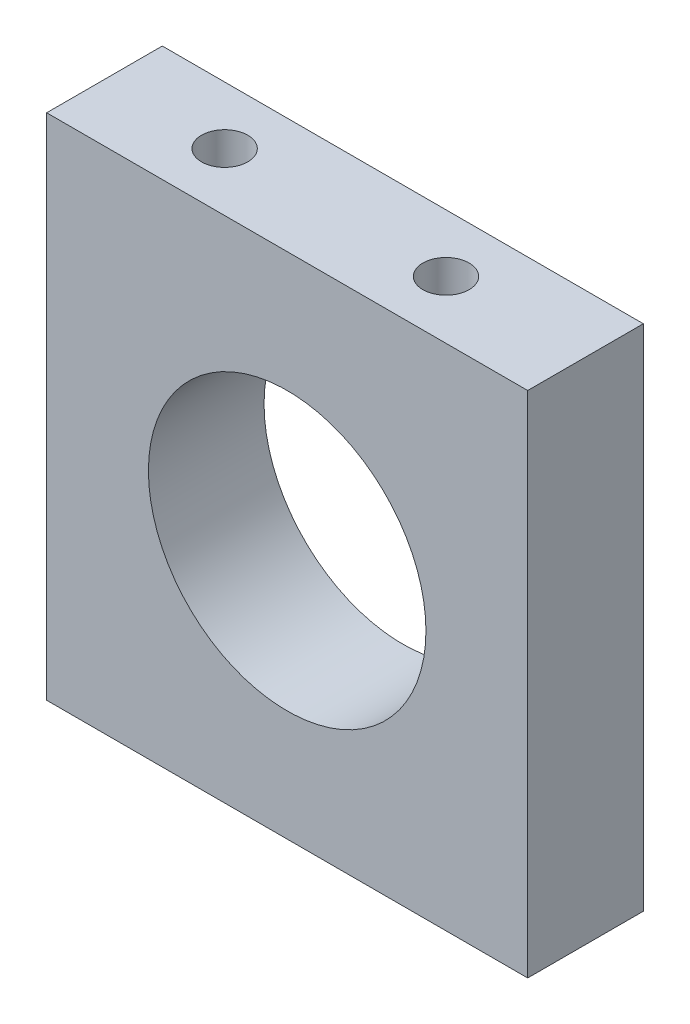
ISO-10303-21;
HEADER;
FILE_DESCRIPTION(('STEP AP214'),'2;1');
FILE_NAME('part.step','',(''),(''),'','','');
FILE_SCHEMA(('AUTOMOTIVE_DESIGN { 1 0 10303 214 1 1 1 1 }'));
ENDSEC;
DATA;
#1=APPLICATION_CONTEXT('core data for automotive mechanical design processes');
#2=APPLICATION_PROTOCOL_DEFINITION('international standard','automotive_design',2000,#1);
#3=PRODUCT_CONTEXT('',#1,'mechanical');
#4=PRODUCT('Part','Part','',(#3));
#5=PRODUCT_RELATED_PRODUCT_CATEGORY('part','',(#4));
#6=PRODUCT_DEFINITION_FORMATION('','',#4);
#7=PRODUCT_DEFINITION_CONTEXT('part definition',#1,'design');
#8=PRODUCT_DEFINITION('design','',#6,#7);
#9=PRODUCT_DEFINITION_SHAPE('','',#8);
#10=(LENGTH_UNIT() NAMED_UNIT(*) SI_UNIT(.MILLI.,.METRE.));
#11=(NAMED_UNIT(*) PLANE_ANGLE_UNIT() SI_UNIT($,.RADIAN.));
#12=(NAMED_UNIT(*) SI_UNIT($,.STERADIAN.) SOLID_ANGLE_UNIT());
#13=UNCERTAINTY_MEASURE_WITH_UNIT(LENGTH_MEASURE(1.E-05),#10,'distance_accuracy_value','');
#14=(GEOMETRIC_REPRESENTATION_CONTEXT(3) GLOBAL_UNCERTAINTY_ASSIGNED_CONTEXT((#13)) GLOBAL_UNIT_ASSIGNED_CONTEXT((#10,
#11,#12)) REPRESENTATION_CONTEXT('',''));
#15=CARTESIAN_POINT('',(0.,0.,0.));
#16=DIRECTION('',(0.,0.,1.));
#17=DIRECTION('',(1.,0.,0.));
#18=AXIS2_PLACEMENT_3D('',#15,#16,#17);
#19=CARTESIAN_POINT('',(26.,0.,12.5));
#20=DIRECTION('',(-1.,0.,0.));
#21=DIRECTION('',(0.,0.,1.));
#22=AXIS2_PLACEMENT_3D('',#19,#20,#21);
#23=PLANE('',#22);
#24=DIRECTION('',(0.,1.,0.));
#25=VECTOR('',#24,1.);
#26=CARTESIAN_POINT('',(26.,0.,0.));
#27=LINE('',#26,#25);
#28=CARTESIAN_POINT('',(26.,0.,0.));
#29=VERTEX_POINT('',#28);
#30=CARTESIAN_POINT('',(26.,55.,0.));
#31=VERTEX_POINT('',#30);
#32=EDGE_CURVE('E124',#29,#31,#27,.T.);
#33=ORIENTED_EDGE('',*,*,#32,.T.);
#34=DIRECTION('',(0.,0.,-1.));
#35=VECTOR('',#34,1.);
#36=CARTESIAN_POINT('',(26.,55.,12.5));
#37=LINE('',#36,#35);
#38=CARTESIAN_POINT('',(26.,55.,12.5));
#39=VERTEX_POINT('',#38);
#40=EDGE_CURVE('E11',#39,#31,#37,.T.);
#41=ORIENTED_EDGE('',*,*,#40,.F.);
#42=DIRECTION('',(0.,1.,0.));
#43=VECTOR('',#42,1.);
#44=CARTESIAN_POINT('',(26.,0.,12.5));
#45=LINE('',#44,#43);
#46=CARTESIAN_POINT('',(26.,0.,12.5));
#47=VERTEX_POINT('',#46);
#48=EDGE_CURVE('E128',#47,#39,#45,.T.);
#49=ORIENTED_EDGE('',*,*,#48,.F.);
#50=DIRECTION('',(0.,0.,-1.));
#51=VECTOR('',#50,1.);
#52=CARTESIAN_POINT('',(26.,0.,12.5));
#53=LINE('',#52,#51);
#54=EDGE_CURVE('E138',#47,#29,#53,.T.);
#55=ORIENTED_EDGE('',*,*,#54,.T.);
#56=EDGE_LOOP('',(#33,#41,#49,#55));
#57=FACE_BOUND('',#56,.T.);
#58=ADVANCED_FACE('F39',(#57),#23,.F.);
#59=CARTESIAN_POINT('',(-26.,55.,12.5));
#60=DIRECTION('',(0.,-1.,0.));
#61=DIRECTION('',(1.,0.,0.));
#62=AXIS2_PLACEMENT_3D('',#59,#60,#61);
#63=PLANE('',#62);
#64=CARTESIAN_POINT('',(-13.0308514830517,55.,6.22919875343797));
#65=DIRECTION('',(0.,1.,0.));
#66=DIRECTION('',(0.,0.,1.));
#67=AXIS2_PLACEMENT_3D('',#64,#65,#66);
#68=CIRCLE('',#67,2.5);
#69=CARTESIAN_POINT('',(-13.0308514830517,55.,8.72919875343797));
#70=VERTEX_POINT('',#69);
#71=EDGE_CURVE('E106',#70,#70,#68,.T.);
#72=ORIENTED_EDGE('',*,*,#71,.F.);
#73=EDGE_LOOP('',(#72));
#74=FACE_BOUND('',#73,.T.);
#75=CARTESIAN_POINT('',(10.8978131775252,55.,6.22919875343797));
#76=DIRECTION('',(0.,1.,0.));
#77=DIRECTION('',(0.,0.,1.));
#78=AXIS2_PLACEMENT_3D('',#75,#76,#77);
#79=CIRCLE('',#78,2.5);
#80=CARTESIAN_POINT('',(10.8978131775252,55.,8.72919875343797));
#81=VERTEX_POINT('',#80);
#82=EDGE_CURVE('E105',#81,#81,#79,.T.);
#83=ORIENTED_EDGE('',*,*,#82,.F.);
#84=EDGE_LOOP('',(#83));
#85=FACE_BOUND('',#84,.T.);
#86=DIRECTION('',(-1.,0.,0.));
#87=VECTOR('',#86,1.);
#88=CARTESIAN_POINT('',(-26.,55.,0.));
#89=LINE('',#88,#87);
#90=CARTESIAN_POINT('',(-26.,55.,0.));
#91=VERTEX_POINT('',#90);
#92=EDGE_CURVE('E142',#31,#91,#89,.T.);
#93=ORIENTED_EDGE('',*,*,#92,.T.);
#94=DIRECTION('',(0.,0.,-1.));
#95=VECTOR('',#94,1.);
#96=CARTESIAN_POINT('',(-26.,55.,12.5));
#97=LINE('',#96,#95);
#98=CARTESIAN_POINT('',(-26.,55.,12.5));
#99=VERTEX_POINT('',#98);
#100=EDGE_CURVE('E48',#99,#91,#97,.T.);
#101=ORIENTED_EDGE('',*,*,#100,.F.);
#102=DIRECTION('',(-1.,0.,0.));
#103=VECTOR('',#102,1.);
#104=CARTESIAN_POINT('',(-26.,55.,12.5));
#105=LINE('',#104,#103);
#106=EDGE_CURVE('E87',#39,#99,#105,.T.);
#107=ORIENTED_EDGE('',*,*,#106,.F.);
#108=ORIENTED_EDGE('',*,*,#40,.T.);
#109=EDGE_LOOP('',(#93,#101,#107,#108));
#110=FACE_BOUND('',#109,.T.);
#111=ADVANCED_FACE('F172',(#74,#85,#110),#63,.F.);
#112=CARTESIAN_POINT('',(-25.9999999999995,-1.66533453693773E-13,12.5));
#113=DIRECTION('',(1.,0.,0.));
#114=DIRECTION('',(0.,1.,0.));
#115=AXIS2_PLACEMENT_3D('',#112,#113,#114);
#116=PLANE('',#115);
#117=DIRECTION('',(0.,-1.,0.));
#118=VECTOR('',#117,1.);
#119=CARTESIAN_POINT('',(-25.9999999999995,-1.66533453693773E-13,0.));
#120=LINE('',#119,#118);
#121=CARTESIAN_POINT('',(-25.9999999999995,-1.66533453693773E-13,0.));
#122=VERTEX_POINT('',#121);
#123=EDGE_CURVE('E74',#91,#122,#120,.T.);
#124=ORIENTED_EDGE('',*,*,#123,.T.);
#125=DIRECTION('',(0.,0.,-1.));
#126=VECTOR('',#125,1.);
#127=CARTESIAN_POINT('',(-25.9999999999995,-1.66533453693773E-13,12.5));
#128=LINE('',#127,#126);
#129=CARTESIAN_POINT('',(-25.9999999999995,-1.66533453693773E-13,12.5));
#130=VERTEX_POINT('',#129);
#131=EDGE_CURVE('E151',#130,#122,#128,.T.);
#132=ORIENTED_EDGE('',*,*,#131,.F.);
#133=DIRECTION('',(0.,-1.,0.));
#134=VECTOR('',#133,1.);
#135=CARTESIAN_POINT('',(-25.9999999999995,-1.66533453693773E-13,12.5));
#136=LINE('',#135,#134);
#137=EDGE_CURVE('E133',#99,#130,#136,.T.);
#138=ORIENTED_EDGE('',*,*,#137,.F.);
#139=ORIENTED_EDGE('',*,*,#100,.T.);
#140=EDGE_LOOP('',(#124,#132,#138,#139));
#141=FACE_BOUND('',#140,.T.);
#142=ADVANCED_FACE('F155',(#141),#116,.F.);
#143=CARTESIAN_POINT('',(-25.9999999999995,-1.66533453693773E-13,12.5));
#144=DIRECTION('',(0.,1.,0.));
#145=DIRECTION('',(-1.,0.,0.));
#146=AXIS2_PLACEMENT_3D('',#143,#144,#145);
#147=PLANE('',#146);
#148=DIRECTION('',(1.,0.,0.));
#149=VECTOR('',#148,1.);
#150=CARTESIAN_POINT('',(-25.9999999999995,-1.66533453693773E-13,0.));
#151=LINE('',#150,#149);
#152=EDGE_CURVE('E80',#122,#29,#151,.T.);
#153=ORIENTED_EDGE('',*,*,#152,.T.);
#154=ORIENTED_EDGE('',*,*,#54,.F.);
#155=DIRECTION('',(1.,0.,0.));
#156=VECTOR('',#155,1.);
#157=CARTESIAN_POINT('',(-25.9999999999995,-1.66533453693773E-13,12.5));
#158=LINE('',#157,#156);
#159=EDGE_CURVE('E56',#130,#47,#158,.T.);
#160=ORIENTED_EDGE('',*,*,#159,.F.);
#161=ORIENTED_EDGE('',*,*,#131,.T.);
#162=EDGE_LOOP('',(#153,#154,#160,#161));
#163=FACE_BOUND('',#162,.T.);
#164=ADVANCED_FACE('F162',(#163),#147,.F.);
#165=CARTESIAN_POINT('',(0.,0.,12.5));
#166=DIRECTION('',(0.,0.,-1.));
#167=DIRECTION('',(-1.,0.,0.));
#168=AXIS2_PLACEMENT_3D('',#165,#166,#167);
#169=PLANE('',#168);
#170=CARTESIAN_POINT('',(1.25340830855659E-13,26.9999999999998,12.5));
#171=DIRECTION('',(0.,0.,1.));
#172=DIRECTION('',(1.,0.,0.));
#173=AXIS2_PLACEMENT_3D('',#170,#171,#172);
#174=CIRCLE('',#173,15.);
#175=CARTESIAN_POINT('',(15.0000000000001,26.9999999999998,12.5));
#176=VERTEX_POINT('',#175);
#177=EDGE_CURVE('E119',#176,#176,#174,.T.);
#178=ORIENTED_EDGE('',*,*,#177,.F.);
#179=EDGE_LOOP('',(#178));
#180=FACE_BOUND('',#179,.T.);
#181=ORIENTED_EDGE('',*,*,#48,.T.);
#182=ORIENTED_EDGE('',*,*,#106,.T.);
#183=ORIENTED_EDGE('',*,*,#137,.T.);
#184=ORIENTED_EDGE('',*,*,#159,.T.);
#185=EDGE_LOOP('',(#181,#182,#183,#184));
#186=FACE_BOUND('',#185,.T.);
#187=ADVANCED_FACE('F164',(#180,#186),#169,.F.);
#188=CARTESIAN_POINT('',(0.,0.,0.));
#189=DIRECTION('',(0.,0.,-1.));
#190=DIRECTION('',(-1.,0.,0.));
#191=AXIS2_PLACEMENT_3D('',#188,#189,#190);
#192=PLANE('',#191);
#193=CARTESIAN_POINT('',(1.25340830855659E-13,26.9999999999998,0.));
#194=DIRECTION('',(0.,0.,1.));
#195=DIRECTION('',(1.,0.,0.));
#196=AXIS2_PLACEMENT_3D('',#193,#194,#195);
#197=CIRCLE('',#196,15.);
#198=CARTESIAN_POINT('',(15.0000000000001,26.9999999999998,0.));
#199=VERTEX_POINT('',#198);
#200=EDGE_CURVE('E120',#199,#199,#197,.T.);
#201=ORIENTED_EDGE('',*,*,#200,.T.);
#202=EDGE_LOOP('',(#201));
#203=FACE_BOUND('',#202,.T.);
#204=ORIENTED_EDGE('',*,*,#32,.F.);
#205=ORIENTED_EDGE('',*,*,#152,.F.);
#206=ORIENTED_EDGE('',*,*,#123,.F.);
#207=ORIENTED_EDGE('',*,*,#92,.F.);
#208=EDGE_LOOP('',(#204,#205,#206,#207));
#209=FACE_BOUND('',#208,.T.);
#210=ADVANCED_FACE('F158',(#203,#209),#192,.T.);
#211=CARTESIAN_POINT('',(1.25340830855659E-13,26.9999999999998,0.));
#212=DIRECTION('',(0.,0.,1.));
#213=DIRECTION('',(1.,0.,0.));
#214=AXIS2_PLACEMENT_3D('',#211,#212,#213);
#215=CYLINDRICAL_SURFACE('',#214,15.);
#216=ORIENTED_EDGE('',*,*,#200,.F.);
#217=EDGE_LOOP('',(#216));
#218=FACE_BOUND('',#217,.T.);
#219=ORIENTED_EDGE('',*,*,#177,.T.);
#220=EDGE_LOOP('',(#219));
#221=FACE_BOUND('',#220,.T.);
#222=ADVANCED_FACE('F193',(#218,#221),#215,.F.);
#223=CARTESIAN_POINT('',(10.8978131775252,45.,6.22919875343797));
#224=DIRECTION('',(0.,1.,0.));
#225=DIRECTION('',(0.,0.,1.));
#226=AXIS2_PLACEMENT_3D('',#223,#224,#225);
#227=CONICAL_SURFACE('',#226,2.5,1.02974425867665);
#228=CARTESIAN_POINT('',(10.8978131775252,43.4978484524311,6.22919875343797));
#229=VERTEX_POINT('',#228);
#230=VERTEX_LOOP('',#229);
#231=FACE_BOUND('',#230,.T.);
#232=CARTESIAN_POINT('',(10.8978131775252,45.,6.22919875343797));
#233=DIRECTION('',(0.,1.,0.));
#234=DIRECTION('',(0.,0.,1.));
#235=AXIS2_PLACEMENT_3D('',#232,#233,#234);
#236=CIRCLE('',#235,2.5);
#237=CARTESIAN_POINT('',(10.8978131775252,45.,8.72919875343797));
#238=VERTEX_POINT('',#237);
#239=EDGE_CURVE('E111',#238,#238,#236,.T.);
#240=ORIENTED_EDGE('',*,*,#239,.T.);
#241=EDGE_LOOP('',(#240));
#242=FACE_BOUND('',#241,.T.);
#243=ADVANCED_FACE('F187',(#231,#242),#227,.F.);
#244=CARTESIAN_POINT('',(10.8978131775252,55.,6.22919875343797));
#245=DIRECTION('',(0.,1.,0.));
#246=DIRECTION('',(0.,0.,1.));
#247=AXIS2_PLACEMENT_3D('',#244,#245,#246);
#248=CYLINDRICAL_SURFACE('',#247,2.5);
#249=ORIENTED_EDGE('',*,*,#239,.F.);
#250=EDGE_LOOP('',(#249));
#251=FACE_BOUND('',#250,.T.);
#252=ORIENTED_EDGE('',*,*,#82,.T.);
#253=EDGE_LOOP('',(#252));
#254=FACE_BOUND('',#253,.T.);
#255=ADVANCED_FACE('F98',(#251,#254),#248,.F.);
#256=CARTESIAN_POINT('',(-13.0308514830517,45.,6.22919875343797));
#257=DIRECTION('',(0.,1.,0.));
#258=DIRECTION('',(0.,0.,1.));
#259=AXIS2_PLACEMENT_3D('',#256,#257,#258);
#260=CONICAL_SURFACE('',#259,2.5,1.02974425867665);
#261=CARTESIAN_POINT('',(-13.0308514830517,43.4978484524311,6.22919875343797));
#262=VERTEX_POINT('',#261);
#263=VERTEX_LOOP('',#262);
#264=FACE_BOUND('',#263,.T.);
#265=CARTESIAN_POINT('',(-13.0308514830517,45.,6.22919875343797));
#266=DIRECTION('',(0.,1.,0.));
#267=DIRECTION('',(0.,0.,1.));
#268=AXIS2_PLACEMENT_3D('',#265,#266,#267);
#269=CIRCLE('',#268,2.5);
#270=CARTESIAN_POINT('',(-13.0308514830517,45.,8.72919875343797));
#271=VERTEX_POINT('',#270);
#272=EDGE_CURVE('E102',#271,#271,#269,.T.);
#273=ORIENTED_EDGE('',*,*,#272,.T.);
#274=EDGE_LOOP('',(#273));
#275=FACE_BOUND('',#274,.T.);
#276=ADVANCED_FACE('F94',(#264,#275),#260,.F.);
#277=CARTESIAN_POINT('',(-13.0308514830517,55.,6.22919875343797));
#278=DIRECTION('',(0.,1.,0.));
#279=DIRECTION('',(0.,0.,1.));
#280=AXIS2_PLACEMENT_3D('',#277,#278,#279);
#281=CYLINDRICAL_SURFACE('',#280,2.5);
#282=ORIENTED_EDGE('',*,*,#272,.F.);
#283=EDGE_LOOP('',(#282));
#284=FACE_BOUND('',#283,.T.);
#285=ORIENTED_EDGE('',*,*,#71,.T.);
#286=EDGE_LOOP('',(#285));
#287=FACE_BOUND('',#286,.T.);
#288=ADVANCED_FACE('F97',(#284,#287),#281,.F.);
#289=CLOSED_SHELL('',(#58,#111,#142,#164,#187,#210,#222,#243,#255,#276,#288));
#290=MANIFOLD_SOLID_BREP('B2',#289);
#291=ADVANCED_BREP_SHAPE_REPRESENTATION('',(#18,#290),#14);
#292=SHAPE_DEFINITION_REPRESENTATION(#9,#291);
ENDSEC;
END-ISO-10303-21;
